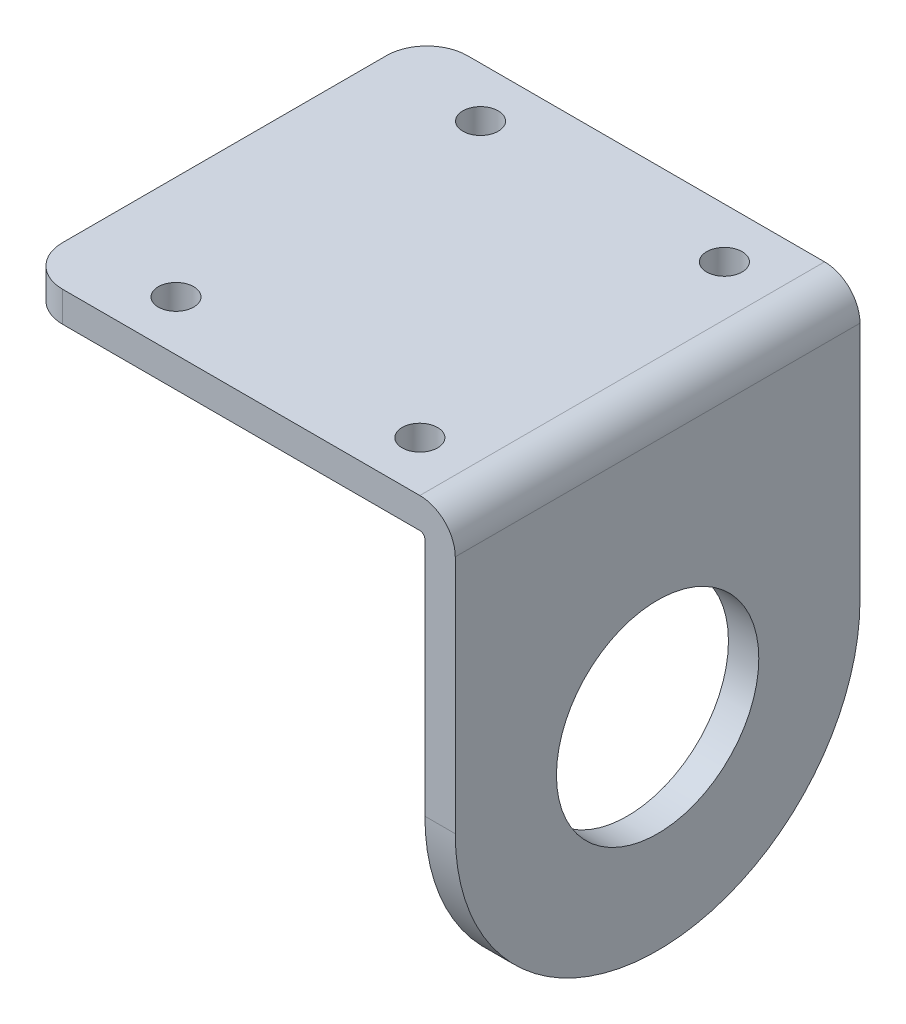
ISO-10303-21;
HEADER;
FILE_DESCRIPTION(('STEP AP214'),'2;1');
FILE_NAME('part.step','',(''),(''),'','','');
FILE_SCHEMA(('AUTOMOTIVE_DESIGN { 1 0 10303 214 1 1 1 1 }'));
ENDSEC;
DATA;
#1=APPLICATION_CONTEXT('core data for automotive mechanical design processes');
#2=APPLICATION_PROTOCOL_DEFINITION('international standard','automotive_design',2000,#1);
#3=PRODUCT_CONTEXT('',#1,'mechanical');
#4=PRODUCT('Part','Part','',(#3));
#5=PRODUCT_RELATED_PRODUCT_CATEGORY('part','',(#4));
#6=PRODUCT_DEFINITION_FORMATION('','',#4);
#7=PRODUCT_DEFINITION_CONTEXT('part definition',#1,'design');
#8=PRODUCT_DEFINITION('design','',#6,#7);
#9=PRODUCT_DEFINITION_SHAPE('','',#8);
#10=(LENGTH_UNIT() NAMED_UNIT(*) SI_UNIT(.MILLI.,.METRE.));
#11=(NAMED_UNIT(*) PLANE_ANGLE_UNIT() SI_UNIT($,.RADIAN.));
#12=(NAMED_UNIT(*) SI_UNIT($,.STERADIAN.) SOLID_ANGLE_UNIT());
#13=UNCERTAINTY_MEASURE_WITH_UNIT(LENGTH_MEASURE(1.E-05),#10,'distance_accuracy_value','');
#14=(GEOMETRIC_REPRESENTATION_CONTEXT(3) GLOBAL_UNCERTAINTY_ASSIGNED_CONTEXT((#13)) GLOBAL_UNIT_ASSIGNED_CONTEXT((#10,
#11,#12)) REPRESENTATION_CONTEXT('',''));
#15=CARTESIAN_POINT('',(0.,0.,0.));
#16=DIRECTION('',(0.,0.,1.));
#17=DIRECTION('',(1.,0.,0.));
#18=AXIS2_PLACEMENT_3D('',#15,#16,#17);
#19=CARTESIAN_POINT('',(3.,0.,20.));
#20=DIRECTION('',(0.,0.,1.));
#21=DIRECTION('',(1.,0.,0.));
#22=AXIS2_PLACEMENT_3D('',#19,#20,#21);
#23=PLANE('',#22);
#24=DIRECTION('',(-1.,0.,0.));
#25=VECTOR('',#24,1.);
#26=CARTESIAN_POINT('',(3.,27.2,20.));
#27=LINE('',#26,#25);
#28=CARTESIAN_POINT('',(-0.5,27.2,20.));
#29=VERTEX_POINT('',#28);
#30=CARTESIAN_POINT('',(-35.8,27.2,20.));
#31=VERTEX_POINT('',#30);
#32=EDGE_CURVE('E156',#29,#31,#27,.T.);
#33=ORIENTED_EDGE('',*,*,#32,.T.);
#34=DIRECTION('',(0.,-1.,0.));
#35=VECTOR('',#34,1.);
#36=CARTESIAN_POINT('',(-35.8,24.2,20.));
#37=LINE('',#36,#35);
#38=CARTESIAN_POINT('',(-35.8,24.2,20.));
#39=VERTEX_POINT('',#38);
#40=EDGE_CURVE('E185',#31,#39,#37,.T.);
#41=ORIENTED_EDGE('',*,*,#40,.T.);
#42=DIRECTION('',(1.,0.,0.));
#43=VECTOR('',#42,1.);
#44=CARTESIAN_POINT('',(-39.8,24.2,20.));
#45=LINE('',#44,#43);
#46=CARTESIAN_POINT('',(-0.5,24.2,20.));
#47=VERTEX_POINT('',#46);
#48=EDGE_CURVE('E149',#39,#47,#45,.T.);
#49=ORIENTED_EDGE('',*,*,#48,.T.);
#50=CARTESIAN_POINT('',(-0.5,23.7,20.));
#51=DIRECTION('',(0.,0.,1.));
#52=DIRECTION('',(1.,0.,0.));
#53=AXIS2_PLACEMENT_3D('',#50,#51,#52);
#54=CIRCLE('',#53,0.5);
#55=CARTESIAN_POINT('',(0.,23.7,20.));
#56=VERTEX_POINT('',#55);
#57=EDGE_CURVE('E175',#47,#56,#54,.F.);
#58=ORIENTED_EDGE('',*,*,#57,.T.);
#59=DIRECTION('',(0.,1.,0.));
#60=VECTOR('',#59,1.);
#61=CARTESIAN_POINT('',(0.,0.,20.));
#62=LINE('',#61,#60);
#63=CARTESIAN_POINT('',(0.,0.,20.));
#64=VERTEX_POINT('',#63);
#65=EDGE_CURVE('E123',#64,#56,#62,.T.);
#66=ORIENTED_EDGE('',*,*,#65,.F.);
#67=DIRECTION('',(-1.,0.,0.));
#68=VECTOR('',#67,1.);
#69=CARTESIAN_POINT('',(3.,0.,20.));
#70=LINE('',#69,#68);
#71=CARTESIAN_POINT('',(3.,0.,20.));
#72=VERTEX_POINT('',#71);
#73=EDGE_CURVE('E116',#72,#64,#70,.T.);
#74=ORIENTED_EDGE('',*,*,#73,.F.);
#75=DIRECTION('',(0.,1.,0.));
#76=VECTOR('',#75,1.);
#77=CARTESIAN_POINT('',(3.,0.,20.));
#78=LINE('',#77,#76);
#79=CARTESIAN_POINT('',(3.,23.7,20.));
#80=VERTEX_POINT('',#79);
#81=EDGE_CURVE('E120',#72,#80,#78,.T.);
#82=ORIENTED_EDGE('',*,*,#81,.T.);
#83=CARTESIAN_POINT('',(-0.5,23.7,20.));
#84=DIRECTION('',(0.,0.,1.));
#85=DIRECTION('',(1.,0.,0.));
#86=AXIS2_PLACEMENT_3D('',#83,#84,#85);
#87=CIRCLE('',#86,3.5);
#88=EDGE_CURVE('E183',#80,#29,#87,.T.);
#89=ORIENTED_EDGE('',*,*,#88,.T.);
#90=EDGE_LOOP('',(#33,#41,#49,#58,#66,#74,#82,#89));
#91=FACE_BOUND('',#90,.T.);
#92=ADVANCED_FACE('F35',(#91),#23,.T.);
#93=CARTESIAN_POINT('',(3.,0.,0.));
#94=DIRECTION('',(-1.,0.,0.));
#95=DIRECTION('',(0.,0.,1.));
#96=AXIS2_PLACEMENT_3D('',#93,#94,#95);
#97=CYLINDRICAL_SURFACE('',#96,20.);
#98=CARTESIAN_POINT('',(0.,0.,0.));
#99=DIRECTION('',(1.,0.,0.));
#100=DIRECTION('',(0.,0.,-1.));
#101=AXIS2_PLACEMENT_3D('',#98,#99,#100);
#102=CIRCLE('',#101,20.);
#103=CARTESIAN_POINT('',(0.,0.,-20.));
#104=VERTEX_POINT('',#103);
#105=EDGE_CURVE('E158',#64,#104,#102,.T.);
#106=ORIENTED_EDGE('',*,*,#105,.T.);
#107=DIRECTION('',(-1.,0.,0.));
#108=VECTOR('',#107,1.);
#109=CARTESIAN_POINT('',(3.,0.,-20.));
#110=LINE('',#109,#108);
#111=CARTESIAN_POINT('',(3.,0.,-20.));
#112=VERTEX_POINT('',#111);
#113=EDGE_CURVE('E128',#112,#104,#110,.T.);
#114=ORIENTED_EDGE('',*,*,#113,.F.);
#115=CARTESIAN_POINT('',(3.,0.,0.));
#116=DIRECTION('',(1.,0.,0.));
#117=DIRECTION('',(0.,0.,-1.));
#118=AXIS2_PLACEMENT_3D('',#115,#116,#117);
#119=CIRCLE('',#118,20.);
#120=EDGE_CURVE('E132',#72,#112,#119,.T.);
#121=ORIENTED_EDGE('',*,*,#120,.F.);
#122=ORIENTED_EDGE('',*,*,#73,.T.);
#123=EDGE_LOOP('',(#106,#114,#121,#122));
#124=FACE_BOUND('',#123,.T.);
#125=ADVANCED_FACE('F133',(#124),#97,.T.);
#126=CARTESIAN_POINT('',(3.,0.,-20.));
#127=DIRECTION('',(0.,0.,-1.));
#128=DIRECTION('',(-1.,0.,0.));
#129=AXIS2_PLACEMENT_3D('',#126,#127,#128);
#130=PLANE('',#129);
#131=DIRECTION('',(1.,0.,0.));
#132=VECTOR('',#131,1.);
#133=CARTESIAN_POINT('',(-39.8,24.2,-20.));
#134=LINE('',#133,#132);
#135=CARTESIAN_POINT('',(-35.8,24.2,-20.));
#136=VERTEX_POINT('',#135);
#137=CARTESIAN_POINT('',(-0.5,24.2,-20.));
#138=VERTEX_POINT('',#137);
#139=EDGE_CURVE('E159',#136,#138,#134,.T.);
#140=ORIENTED_EDGE('',*,*,#139,.F.);
#141=DIRECTION('',(0.,1.,0.));
#142=VECTOR('',#141,1.);
#143=CARTESIAN_POINT('',(-35.8,27.2,-20.));
#144=LINE('',#143,#142);
#145=CARTESIAN_POINT('',(-35.8,27.2,-20.));
#146=VERTEX_POINT('',#145);
#147=EDGE_CURVE('E11',#136,#146,#144,.T.);
#148=ORIENTED_EDGE('',*,*,#147,.T.);
#149=DIRECTION('',(-1.,0.,0.));
#150=VECTOR('',#149,1.);
#151=CARTESIAN_POINT('',(3.,27.2,-20.));
#152=LINE('',#151,#150);
#153=CARTESIAN_POINT('',(-0.5,27.2,-20.));
#154=VERTEX_POINT('',#153);
#155=EDGE_CURVE('E163',#154,#146,#152,.T.);
#156=ORIENTED_EDGE('',*,*,#155,.F.);
#157=CARTESIAN_POINT('',(-0.5,23.7,-20.));
#158=DIRECTION('',(0.,0.,-1.));
#159=DIRECTION('',(-1.,0.,0.));
#160=AXIS2_PLACEMENT_3D('',#157,#158,#159);
#161=CIRCLE('',#160,3.5);
#162=CARTESIAN_POINT('',(3.,23.7,-20.));
#163=VERTEX_POINT('',#162);
#164=EDGE_CURVE('E180',#154,#163,#161,.T.);
#165=ORIENTED_EDGE('',*,*,#164,.T.);
#166=DIRECTION('',(0.,-1.,0.));
#167=VECTOR('',#166,1.);
#168=CARTESIAN_POINT('',(3.,0.,-20.));
#169=LINE('',#168,#167);
#170=EDGE_CURVE('E137',#163,#112,#169,.T.);
#171=ORIENTED_EDGE('',*,*,#170,.T.);
#172=ORIENTED_EDGE('',*,*,#113,.T.);
#173=DIRECTION('',(0.,-1.,0.));
#174=VECTOR('',#173,1.);
#175=CARTESIAN_POINT('',(0.,0.,-20.));
#176=LINE('',#175,#174);
#177=CARTESIAN_POINT('',(0.,23.7,-20.));
#178=VERTEX_POINT('',#177);
#179=EDGE_CURVE('E146',#178,#104,#176,.T.);
#180=ORIENTED_EDGE('',*,*,#179,.F.);
#181=CARTESIAN_POINT('',(-0.5,23.7,-20.));
#182=DIRECTION('',(0.,0.,-1.));
#183=DIRECTION('',(-1.,0.,0.));
#184=AXIS2_PLACEMENT_3D('',#181,#182,#183);
#185=CIRCLE('',#184,0.5);
#186=EDGE_CURVE('E172',#178,#138,#185,.F.);
#187=ORIENTED_EDGE('',*,*,#186,.T.);
#188=EDGE_LOOP('',(#140,#148,#156,#165,#171,#172,#180,#187));
#189=FACE_BOUND('',#188,.T.);
#190=ADVANCED_FACE('F233',(#189),#130,.T.);
#191=CARTESIAN_POINT('',(3.,27.2,0.));
#192=DIRECTION('',(0.,1.,0.));
#193=DIRECTION('',(0.,0.,1.));
#194=AXIS2_PLACEMENT_3D('',#191,#192,#193);
#195=PLANE('',#194);
#196=CARTESIAN_POINT('',(-5.44999999999999,27.2,-15.05));
#197=DIRECTION('',(0.,1.,0.));
#198=DIRECTION('',(0.,0.,1.));
#199=AXIS2_PLACEMENT_3D('',#196,#197,#198);
#200=CIRCLE('',#199,1.75);
#201=CARTESIAN_POINT('',(-5.44999999999999,27.2,-13.3));
#202=VERTEX_POINT('',#201);
#203=EDGE_CURVE('E410',#202,#202,#200,.T.);
#204=ORIENTED_EDGE('',*,*,#203,.F.);
#205=EDGE_LOOP('',(#204));
#206=FACE_BOUND('',#205,.T.);
#207=CARTESIAN_POINT('',(-29.55,27.2,15.05));
#208=DIRECTION('',(0.,1.,0.));
#209=DIRECTION('',(0.,0.,1.));
#210=AXIS2_PLACEMENT_3D('',#207,#208,#209);
#211=CIRCLE('',#210,1.75);
#212=CARTESIAN_POINT('',(-29.55,27.2,16.8));
#213=VERTEX_POINT('',#212);
#214=EDGE_CURVE('E411',#213,#213,#211,.T.);
#215=ORIENTED_EDGE('',*,*,#214,.F.);
#216=EDGE_LOOP('',(#215));
#217=FACE_BOUND('',#216,.T.);
#218=CARTESIAN_POINT('',(-5.44999999999999,27.2,15.05));
#219=DIRECTION('',(0.,1.,0.));
#220=DIRECTION('',(0.,0.,1.));
#221=AXIS2_PLACEMENT_3D('',#218,#219,#220);
#222=CIRCLE('',#221,1.75);
#223=CARTESIAN_POINT('',(-5.44999999999999,27.2,16.8));
#224=VERTEX_POINT('',#223);
#225=EDGE_CURVE('E415',#224,#224,#222,.T.);
#226=ORIENTED_EDGE('',*,*,#225,.F.);
#227=EDGE_LOOP('',(#226));
#228=FACE_BOUND('',#227,.T.);
#229=CARTESIAN_POINT('',(-29.55,27.2,-15.05));
#230=DIRECTION('',(0.,1.,0.));
#231=DIRECTION('',(0.,0.,1.));
#232=AXIS2_PLACEMENT_3D('',#229,#230,#231);
#233=CIRCLE('',#232,1.75);
#234=CARTESIAN_POINT('',(-29.55,27.2,-13.3));
#235=VERTEX_POINT('',#234);
#236=EDGE_CURVE('E201',#235,#235,#233,.T.);
#237=ORIENTED_EDGE('',*,*,#236,.F.);
#238=EDGE_LOOP('',(#237));
#239=FACE_BOUND('',#238,.T.);
#240=DIRECTION('',(0.,0.,1.));
#241=VECTOR('',#240,1.);
#242=CARTESIAN_POINT('',(-39.8,27.2,20.));
#243=LINE('',#242,#241);
#244=CARTESIAN_POINT('',(-39.8,27.2,-16.));
#245=VERTEX_POINT('',#244);
#246=CARTESIAN_POINT('',(-39.8,27.2,16.));
#247=VERTEX_POINT('',#246);
#248=EDGE_CURVE('E212',#245,#247,#243,.T.);
#249=ORIENTED_EDGE('',*,*,#248,.T.);
#250=CARTESIAN_POINT('',(-35.8,27.2,16.));
#251=DIRECTION('',(0.,1.,0.));
#252=DIRECTION('',(0.,0.,1.));
#253=AXIS2_PLACEMENT_3D('',#250,#251,#252);
#254=CIRCLE('',#253,4.);
#255=EDGE_CURVE('E44',#247,#31,#254,.T.);
#256=ORIENTED_EDGE('',*,*,#255,.T.);
#257=ORIENTED_EDGE('',*,*,#32,.F.);
#258=DIRECTION('',(0.,0.,-1.));
#259=VECTOR('',#258,1.);
#260=CARTESIAN_POINT('',(-0.5,27.2,0.));
#261=LINE('',#260,#259);
#262=EDGE_CURVE('E177',#29,#154,#261,.T.);
#263=ORIENTED_EDGE('',*,*,#262,.T.);
#264=ORIENTED_EDGE('',*,*,#155,.T.);
#265=CARTESIAN_POINT('',(-35.8,27.2,-16.));
#266=DIRECTION('',(0.,1.,0.));
#267=DIRECTION('',(0.,0.,1.));
#268=AXIS2_PLACEMENT_3D('',#265,#266,#267);
#269=CIRCLE('',#268,4.);
#270=EDGE_CURVE('E52',#146,#245,#269,.T.);
#271=ORIENTED_EDGE('',*,*,#270,.T.);
#272=EDGE_LOOP('',(#249,#256,#257,#263,#264,#271));
#273=FACE_BOUND('',#272,.T.);
#274=ADVANCED_FACE('F240',(#206,#217,#228,#239,#273),#195,.T.);
#275=CARTESIAN_POINT('',(3.,0.,0.));
#276=DIRECTION('',(-1.,0.,0.));
#277=DIRECTION('',(0.,0.,1.));
#278=AXIS2_PLACEMENT_3D('',#275,#276,#277);
#279=CYLINDRICAL_SURFACE('',#278,10.);
#280=CARTESIAN_POINT('',(3.,0.,0.));
#281=DIRECTION('',(1.,0.,0.));
#282=DIRECTION('',(0.,0.,-1.));
#283=AXIS2_PLACEMENT_3D('',#280,#281,#282);
#284=CIRCLE('',#283,10.);
#285=CARTESIAN_POINT('',(3.,0.,-10.));
#286=VERTEX_POINT('',#285);
#287=EDGE_CURVE('E153',#286,#286,#284,.T.);
#288=ORIENTED_EDGE('',*,*,#287,.T.);
#289=EDGE_LOOP('',(#288));
#290=FACE_BOUND('',#289,.T.);
#291=CARTESIAN_POINT('',(0.,0.,0.));
#292=DIRECTION('',(1.,0.,0.));
#293=DIRECTION('',(0.,0.,-1.));
#294=AXIS2_PLACEMENT_3D('',#291,#292,#293);
#295=CIRCLE('',#294,10.);
#296=CARTESIAN_POINT('',(0.,0.,-10.));
#297=VERTEX_POINT('',#296);
#298=EDGE_CURVE('E143',#297,#297,#295,.T.);
#299=ORIENTED_EDGE('',*,*,#298,.F.);
#300=EDGE_LOOP('',(#299));
#301=FACE_BOUND('',#300,.T.);
#302=ADVANCED_FACE('F292',(#290,#301),#279,.F.);
#303=CARTESIAN_POINT('',(3.,0.,0.));
#304=DIRECTION('',(1.,0.,0.));
#305=DIRECTION('',(0.,0.,-1.));
#306=AXIS2_PLACEMENT_3D('',#303,#304,#305);
#307=PLANE('',#306);
#308=ORIENTED_EDGE('',*,*,#170,.F.);
#309=DIRECTION('',(0.,0.,-1.));
#310=VECTOR('',#309,1.);
#311=CARTESIAN_POINT('',(3.,23.7,0.));
#312=LINE('',#311,#310);
#313=EDGE_CURVE('E142',#163,#80,#312,.F.);
#314=ORIENTED_EDGE('',*,*,#313,.T.);
#315=ORIENTED_EDGE('',*,*,#81,.F.);
#316=ORIENTED_EDGE('',*,*,#120,.T.);
#317=EDGE_LOOP('',(#308,#314,#315,#316));
#318=FACE_BOUND('',#317,.T.);
#319=ORIENTED_EDGE('',*,*,#287,.F.);
#320=EDGE_LOOP('',(#319));
#321=FACE_BOUND('',#320,.T.);
#322=ADVANCED_FACE('F139',(#318,#321),#307,.T.);
#323=CARTESIAN_POINT('',(0.,0.,0.));
#324=DIRECTION('',(1.,0.,0.));
#325=DIRECTION('',(0.,0.,-1.));
#326=AXIS2_PLACEMENT_3D('',#323,#324,#325);
#327=PLANE('',#326);
#328=ORIENTED_EDGE('',*,*,#65,.T.);
#329=DIRECTION('',(0.,0.,-1.));
#330=VECTOR('',#329,1.);
#331=CARTESIAN_POINT('',(0.,23.7,0.));
#332=LINE('',#331,#330);
#333=EDGE_CURVE('E127',#56,#178,#332,.T.);
#334=ORIENTED_EDGE('',*,*,#333,.T.);
#335=ORIENTED_EDGE('',*,*,#179,.T.);
#336=ORIENTED_EDGE('',*,*,#105,.F.);
#337=EDGE_LOOP('',(#328,#334,#335,#336));
#338=FACE_BOUND('',#337,.T.);
#339=ORIENTED_EDGE('',*,*,#298,.T.);
#340=EDGE_LOOP('',(#339));
#341=FACE_BOUND('',#340,.T.);
#342=ADVANCED_FACE('F230',(#338,#341),#327,.F.);
#343=CARTESIAN_POINT('',(-39.8,24.2,20.));
#344=DIRECTION('',(0.,-1.,0.));
#345=DIRECTION('',(0.,0.,-1.));
#346=AXIS2_PLACEMENT_3D('',#343,#344,#345);
#347=PLANE('',#346);
#348=CARTESIAN_POINT('',(-5.44999999999999,24.2,-15.05));
#349=DIRECTION('',(0.,-1.,0.));
#350=DIRECTION('',(0.,0.,-1.));
#351=AXIS2_PLACEMENT_3D('',#348,#349,#350);
#352=CIRCLE('',#351,1.75);
#353=CARTESIAN_POINT('',(-5.44999999999999,24.2,-16.8));
#354=VERTEX_POINT('',#353);
#355=EDGE_CURVE('E39',#354,#354,#352,.T.);
#356=ORIENTED_EDGE('',*,*,#355,.F.);
#357=EDGE_LOOP('',(#356));
#358=FACE_BOUND('',#357,.T.);
#359=CARTESIAN_POINT('',(-29.55,24.2,15.05));
#360=DIRECTION('',(0.,-1.,0.));
#361=DIRECTION('',(0.,0.,-1.));
#362=AXIS2_PLACEMENT_3D('',#359,#360,#361);
#363=CIRCLE('',#362,1.75);
#364=CARTESIAN_POINT('',(-29.55,24.2,13.3));
#365=VERTEX_POINT('',#364);
#366=EDGE_CURVE('E203',#365,#365,#363,.T.);
#367=ORIENTED_EDGE('',*,*,#366,.F.);
#368=EDGE_LOOP('',(#367));
#369=FACE_BOUND('',#368,.T.);
#370=CARTESIAN_POINT('',(-5.44999999999999,24.2,15.05));
#371=DIRECTION('',(0.,-1.,0.));
#372=DIRECTION('',(0.,0.,-1.));
#373=AXIS2_PLACEMENT_3D('',#370,#371,#372);
#374=CIRCLE('',#373,1.75);
#375=CARTESIAN_POINT('',(-5.44999999999999,24.2,13.3));
#376=VERTEX_POINT('',#375);
#377=EDGE_CURVE('E200',#376,#376,#374,.T.);
#378=ORIENTED_EDGE('',*,*,#377,.F.);
#379=EDGE_LOOP('',(#378));
#380=FACE_BOUND('',#379,.T.);
#381=CARTESIAN_POINT('',(-29.55,24.2,-15.05));
#382=DIRECTION('',(0.,-1.,0.));
#383=DIRECTION('',(0.,0.,-1.));
#384=AXIS2_PLACEMENT_3D('',#381,#382,#383);
#385=CIRCLE('',#384,1.75);
#386=CARTESIAN_POINT('',(-29.55,24.2,-16.8));
#387=VERTEX_POINT('',#386);
#388=EDGE_CURVE('E197',#387,#387,#385,.T.);
#389=ORIENTED_EDGE('',*,*,#388,.F.);
#390=EDGE_LOOP('',(#389));
#391=FACE_BOUND('',#390,.T.);
#392=ORIENTED_EDGE('',*,*,#48,.F.);
#393=CARTESIAN_POINT('',(-35.8,24.2,16.));
#394=DIRECTION('',(0.,-1.,0.));
#395=DIRECTION('',(0.,0.,-1.));
#396=AXIS2_PLACEMENT_3D('',#393,#394,#395);
#397=CIRCLE('',#396,4.);
#398=CARTESIAN_POINT('',(-39.8,24.2,16.));
#399=VERTEX_POINT('',#398);
#400=EDGE_CURVE('E190',#39,#399,#397,.T.);
#401=ORIENTED_EDGE('',*,*,#400,.T.);
#402=DIRECTION('',(0.,0.,-1.));
#403=VECTOR('',#402,1.);
#404=CARTESIAN_POINT('',(-39.8,24.2,20.));
#405=LINE('',#404,#403);
#406=CARTESIAN_POINT('',(-39.8,24.2,-16.));
#407=VERTEX_POINT('',#406);
#408=EDGE_CURVE('E208',#399,#407,#405,.T.);
#409=ORIENTED_EDGE('',*,*,#408,.T.);
#410=CARTESIAN_POINT('',(-35.8,24.2,-16.));
#411=DIRECTION('',(0.,-1.,0.));
#412=DIRECTION('',(0.,0.,-1.));
#413=AXIS2_PLACEMENT_3D('',#410,#411,#412);
#414=CIRCLE('',#413,4.);
#415=EDGE_CURVE('E188',#407,#136,#414,.T.);
#416=ORIENTED_EDGE('',*,*,#415,.T.);
#417=ORIENTED_EDGE('',*,*,#139,.T.);
#418=DIRECTION('',(0.,0.,-1.));
#419=VECTOR('',#418,1.);
#420=CARTESIAN_POINT('',(-0.5,24.2,20.));
#421=LINE('',#420,#419);
#422=EDGE_CURVE('E169',#138,#47,#421,.F.);
#423=ORIENTED_EDGE('',*,*,#422,.T.);
#424=EDGE_LOOP('',(#392,#401,#409,#416,#417,#423));
#425=FACE_BOUND('',#424,.T.);
#426=ADVANCED_FACE('F224',(#358,#369,#380,#391,#425),#347,.T.);
#427=CARTESIAN_POINT('',(-39.8,0.,0.));
#428=DIRECTION('',(1.,0.,0.));
#429=DIRECTION('',(0.,0.,-1.));
#430=AXIS2_PLACEMENT_3D('',#427,#428,#429);
#431=PLANE('',#430);
#432=ORIENTED_EDGE('',*,*,#408,.F.);
#433=DIRECTION('',(0.,-1.,0.));
#434=VECTOR('',#433,1.);
#435=CARTESIAN_POINT('',(-39.8,27.2,16.));
#436=LINE('',#435,#434);
#437=EDGE_CURVE('E59',#399,#247,#436,.F.);
#438=ORIENTED_EDGE('',*,*,#437,.T.);
#439=ORIENTED_EDGE('',*,*,#248,.F.);
#440=DIRECTION('',(0.,1.,0.));
#441=VECTOR('',#440,1.);
#442=CARTESIAN_POINT('',(-39.8,24.2,-16.));
#443=LINE('',#442,#441);
#444=EDGE_CURVE('E192',#245,#407,#443,.F.);
#445=ORIENTED_EDGE('',*,*,#444,.T.);
#446=EDGE_LOOP('',(#432,#438,#439,#445));
#447=FACE_BOUND('',#446,.T.);
#448=ADVANCED_FACE('F244',(#447),#431,.F.);
#449=CARTESIAN_POINT('',(-0.5,23.7,0.));
#450=DIRECTION('',(0.,0.,-1.));
#451=DIRECTION('',(-1.,0.,0.));
#452=AXIS2_PLACEMENT_3D('',#449,#450,#451);
#453=CYLINDRICAL_SURFACE('',#452,0.5);
#454=ORIENTED_EDGE('',*,*,#57,.F.);
#455=ORIENTED_EDGE('',*,*,#422,.F.);
#456=ORIENTED_EDGE('',*,*,#186,.F.);
#457=ORIENTED_EDGE('',*,*,#333,.F.);
#458=EDGE_LOOP('',(#454,#455,#456,#457));
#459=FACE_BOUND('',#458,.T.);
#460=ADVANCED_FACE('F227',(#459),#453,.F.);
#461=CARTESIAN_POINT('',(-0.5,23.7,0.));
#462=DIRECTION('',(0.,0.,-1.));
#463=DIRECTION('',(-1.,0.,0.));
#464=AXIS2_PLACEMENT_3D('',#461,#462,#463);
#465=CYLINDRICAL_SURFACE('',#464,3.5);
#466=ORIENTED_EDGE('',*,*,#88,.F.);
#467=ORIENTED_EDGE('',*,*,#313,.F.);
#468=ORIENTED_EDGE('',*,*,#164,.F.);
#469=ORIENTED_EDGE('',*,*,#262,.F.);
#470=EDGE_LOOP('',(#466,#467,#468,#469));
#471=FACE_BOUND('',#470,.T.);
#472=ADVANCED_FACE('F236',(#471),#465,.T.);
#473=CARTESIAN_POINT('',(-35.8,0.,16.));
#474=DIRECTION('',(0.,1.,0.));
#475=DIRECTION('',(0.,0.,1.));
#476=AXIS2_PLACEMENT_3D('',#473,#474,#475);
#477=CYLINDRICAL_SURFACE('',#476,4.);
#478=ORIENTED_EDGE('',*,*,#255,.F.);
#479=ORIENTED_EDGE('',*,*,#437,.F.);
#480=ORIENTED_EDGE('',*,*,#400,.F.);
#481=ORIENTED_EDGE('',*,*,#40,.F.);
#482=EDGE_LOOP('',(#478,#479,#480,#481));
#483=FACE_BOUND('',#482,.T.);
#484=ADVANCED_FACE('F243',(#483),#477,.T.);
#485=CARTESIAN_POINT('',(-35.8,0.,-16.));
#486=DIRECTION('',(0.,-1.,0.));
#487=DIRECTION('',(0.,0.,-1.));
#488=AXIS2_PLACEMENT_3D('',#485,#486,#487);
#489=CYLINDRICAL_SURFACE('',#488,4.);
#490=ORIENTED_EDGE('',*,*,#415,.F.);
#491=ORIENTED_EDGE('',*,*,#444,.F.);
#492=ORIENTED_EDGE('',*,*,#270,.F.);
#493=ORIENTED_EDGE('',*,*,#147,.F.);
#494=EDGE_LOOP('',(#490,#491,#492,#493));
#495=FACE_BOUND('',#494,.T.);
#496=ADVANCED_FACE('F37',(#495),#489,.T.);
#497=CARTESIAN_POINT('',(-29.55,17.2,-15.05));
#498=DIRECTION('',(0.,1.,0.));
#499=DIRECTION('',(0.,0.,1.));
#500=AXIS2_PLACEMENT_3D('',#497,#498,#499);
#501=CYLINDRICAL_SURFACE('',#500,1.75);
#502=ORIENTED_EDGE('',*,*,#388,.T.);
#503=EDGE_LOOP('',(#502));
#504=FACE_BOUND('',#503,.T.);
#505=ORIENTED_EDGE('',*,*,#236,.T.);
#506=EDGE_LOOP('',(#505));
#507=FACE_BOUND('',#506,.T.);
#508=ADVANCED_FACE('F246',(#504,#507),#501,.F.);
#509=CARTESIAN_POINT('',(-5.44999999999999,17.2,15.05));
#510=DIRECTION('',(0.,1.,0.));
#511=DIRECTION('',(0.,0.,1.));
#512=AXIS2_PLACEMENT_3D('',#509,#510,#511);
#513=CYLINDRICAL_SURFACE('',#512,1.75);
#514=ORIENTED_EDGE('',*,*,#377,.T.);
#515=EDGE_LOOP('',(#514));
#516=FACE_BOUND('',#515,.T.);
#517=ORIENTED_EDGE('',*,*,#225,.T.);
#518=EDGE_LOOP('',(#517));
#519=FACE_BOUND('',#518,.T.);
#520=ADVANCED_FACE('F251',(#516,#519),#513,.F.);
#521=CARTESIAN_POINT('',(-29.55,17.2,15.05));
#522=DIRECTION('',(0.,1.,0.));
#523=DIRECTION('',(0.,0.,1.));
#524=AXIS2_PLACEMENT_3D('',#521,#522,#523);
#525=CYLINDRICAL_SURFACE('',#524,1.75);
#526=ORIENTED_EDGE('',*,*,#366,.T.);
#527=EDGE_LOOP('',(#526));
#528=FACE_BOUND('',#527,.T.);
#529=ORIENTED_EDGE('',*,*,#214,.T.);
#530=EDGE_LOOP('',(#529));
#531=FACE_BOUND('',#530,.T.);
#532=ADVANCED_FACE('F316',(#528,#531),#525,.F.);
#533=CARTESIAN_POINT('',(-5.44999999999999,17.2,-15.05));
#534=DIRECTION('',(0.,1.,0.));
#535=DIRECTION('',(0.,0.,1.));
#536=AXIS2_PLACEMENT_3D('',#533,#534,#535);
#537=CYLINDRICAL_SURFACE('',#536,1.75);
#538=ORIENTED_EDGE('',*,*,#355,.T.);
#539=EDGE_LOOP('',(#538));
#540=FACE_BOUND('',#539,.T.);
#541=ORIENTED_EDGE('',*,*,#203,.T.);
#542=EDGE_LOOP('',(#541));
#543=FACE_BOUND('',#542,.T.);
#544=ADVANCED_FACE('F326',(#540,#543),#537,.F.);
#545=CLOSED_SHELL('',(#92,#125,#190,#274,#302,#322,#342,#426,#448,#460,#472,#484,#496,#508,#520,
#532,#544));
#546=MANIFOLD_SOLID_BREP('B2',#545);
#547=ADVANCED_BREP_SHAPE_REPRESENTATION('',(#18,#546),#14);
#548=SHAPE_DEFINITION_REPRESENTATION(#9,#547);
ENDSEC;
END-ISO-10303-21;
